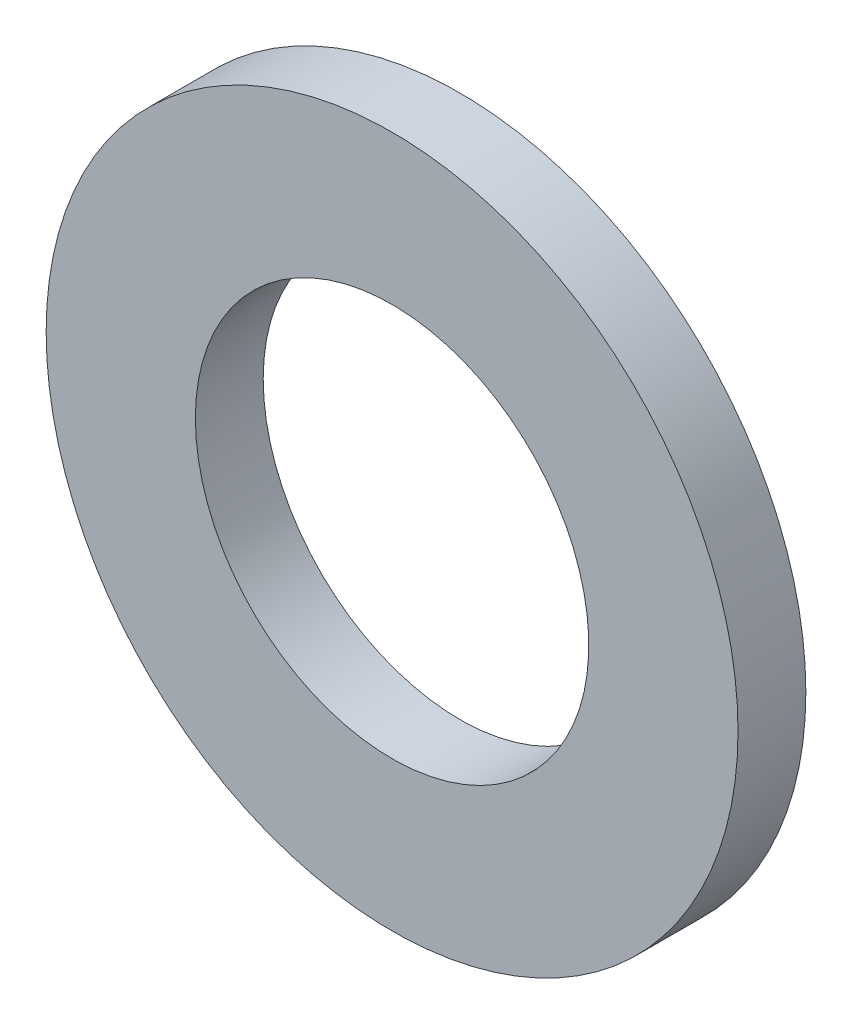
ISO-10303-21;
HEADER;
FILE_DESCRIPTION(('STEP AP214'),'2;1');
FILE_NAME('part.step','',(''),(''),'','','');
FILE_SCHEMA(('AUTOMOTIVE_DESIGN { 1 0 10303 214 1 1 1 1 }'));
ENDSEC;
DATA;
#1=APPLICATION_CONTEXT('core data for automotive mechanical design processes');
#2=APPLICATION_PROTOCOL_DEFINITION('international standard','automotive_design',2000,#1);
#3=PRODUCT_CONTEXT('',#1,'mechanical');
#4=PRODUCT('Part','Part','',(#3));
#5=PRODUCT_RELATED_PRODUCT_CATEGORY('part','',(#4));
#6=PRODUCT_DEFINITION_FORMATION('','',#4);
#7=PRODUCT_DEFINITION_CONTEXT('part definition',#1,'design');
#8=PRODUCT_DEFINITION('design','',#6,#7);
#9=PRODUCT_DEFINITION_SHAPE('','',#8);
#10=(LENGTH_UNIT() NAMED_UNIT(*) SI_UNIT(.MILLI.,.METRE.));
#11=(NAMED_UNIT(*) PLANE_ANGLE_UNIT() SI_UNIT($,.RADIAN.));
#12=(NAMED_UNIT(*) SI_UNIT($,.STERADIAN.) SOLID_ANGLE_UNIT());
#13=UNCERTAINTY_MEASURE_WITH_UNIT(LENGTH_MEASURE(1.E-05),#10,'distance_accuracy_value','');
#14=(GEOMETRIC_REPRESENTATION_CONTEXT(3) GLOBAL_UNCERTAINTY_ASSIGNED_CONTEXT((#13)) GLOBAL_UNIT_ASSIGNED_CONTEXT((#10,
#11,#12)) REPRESENTATION_CONTEXT('',''));
#15=CARTESIAN_POINT('',(0.,0.,0.));
#16=DIRECTION('',(0.,0.,1.));
#17=DIRECTION('',(1.,0.,0.));
#18=AXIS2_PLACEMENT_3D('',#15,#16,#17);
#19=CARTESIAN_POINT('',(2.55,0.,0.5));
#20=DIRECTION('',(0.,0.,1.));
#21=DIRECTION('',(1.,0.,0.));
#22=AXIS2_PLACEMENT_3D('',#19,#20,#21);
#23=PLANE('',#22);
#24=CARTESIAN_POINT('',(0.,0.,0.5));
#25=DIRECTION('',(0.,0.,-1.));
#26=DIRECTION('',(-1.,0.,0.));
#27=AXIS2_PLACEMENT_3D('',#24,#25,#26);
#28=CIRCLE('',#27,1.45);
#29=CARTESIAN_POINT('',(-1.45,0.,0.5));
#30=VERTEX_POINT('',#29);
#31=EDGE_CURVE('E10',#30,#30,#28,.T.);
#32=ORIENTED_EDGE('',*,*,#31,.T.);
#33=EDGE_LOOP('',(#32));
#34=FACE_BOUND('',#33,.T.);
#35=CARTESIAN_POINT('',(0.,0.,0.5));
#36=DIRECTION('',(0.,0.,-1.));
#37=DIRECTION('',(-1.,0.,0.));
#38=AXIS2_PLACEMENT_3D('',#35,#36,#37);
#39=CIRCLE('',#38,2.55);
#40=CARTESIAN_POINT('',(-2.55,0.,0.5));
#41=VERTEX_POINT('',#40);
#42=EDGE_CURVE('E49',#41,#41,#39,.T.);
#43=ORIENTED_EDGE('',*,*,#42,.F.);
#44=EDGE_LOOP('',(#43));
#45=FACE_BOUND('',#44,.T.);
#46=ADVANCED_FACE('F35',(#34,#45),#23,.T.);
#47=CARTESIAN_POINT('',(0.,0.,0.5));
#48=DIRECTION('',(0.,0.,-1.));
#49=DIRECTION('',(-1.,0.,0.));
#50=AXIS2_PLACEMENT_3D('',#47,#48,#49);
#51=CYLINDRICAL_SURFACE('',#50,1.45);
#52=CARTESIAN_POINT('',(0.,0.,0.));
#53=DIRECTION('',(0.,0.,-1.));
#54=DIRECTION('',(-1.,0.,0.));
#55=AXIS2_PLACEMENT_3D('',#52,#53,#54);
#56=CIRCLE('',#55,1.45);
#57=CARTESIAN_POINT('',(-1.45,0.,0.));
#58=VERTEX_POINT('',#57);
#59=EDGE_CURVE('E41',#58,#58,#56,.T.);
#60=ORIENTED_EDGE('',*,*,#59,.T.);
#61=EDGE_LOOP('',(#60));
#62=FACE_BOUND('',#61,.T.);
#63=ORIENTED_EDGE('',*,*,#31,.F.);
#64=EDGE_LOOP('',(#63));
#65=FACE_BOUND('',#64,.T.);
#66=ADVANCED_FACE('F59',(#62,#65),#51,.F.);
#67=CARTESIAN_POINT('',(1.45,0.,0.));
#68=DIRECTION('',(0.,0.,-1.));
#69=DIRECTION('',(-1.,0.,0.));
#70=AXIS2_PLACEMENT_3D('',#67,#68,#69);
#71=PLANE('',#70);
#72=CARTESIAN_POINT('',(0.,0.,0.));
#73=DIRECTION('',(0.,0.,-1.));
#74=DIRECTION('',(-1.,0.,0.));
#75=AXIS2_PLACEMENT_3D('',#72,#73,#74);
#76=CIRCLE('',#75,2.55);
#77=CARTESIAN_POINT('',(-2.55,0.,0.));
#78=VERTEX_POINT('',#77);
#79=EDGE_CURVE('E45',#78,#78,#76,.T.);
#80=ORIENTED_EDGE('',*,*,#79,.T.);
#81=EDGE_LOOP('',(#80));
#82=FACE_BOUND('',#81,.T.);
#83=ORIENTED_EDGE('',*,*,#59,.F.);
#84=EDGE_LOOP('',(#83));
#85=FACE_BOUND('',#84,.T.);
#86=ADVANCED_FACE('F63',(#82,#85),#71,.T.);
#87=CARTESIAN_POINT('',(0.,0.,0.5));
#88=DIRECTION('',(0.,0.,-1.));
#89=DIRECTION('',(-1.,0.,0.));
#90=AXIS2_PLACEMENT_3D('',#87,#88,#89);
#91=CYLINDRICAL_SURFACE('',#90,2.55);
#92=ORIENTED_EDGE('',*,*,#42,.T.);
#93=EDGE_LOOP('',(#92));
#94=FACE_BOUND('',#93,.T.);
#95=ORIENTED_EDGE('',*,*,#79,.F.);
#96=EDGE_LOOP('',(#95));
#97=FACE_BOUND('',#96,.T.);
#98=ADVANCED_FACE('F55',(#94,#97),#91,.T.);
#99=CLOSED_SHELL('',(#46,#66,#86,#98));
#100=MANIFOLD_SOLID_BREP('B2',#99);
#101=ADVANCED_BREP_SHAPE_REPRESENTATION('',(#18,#100),#14);
#102=SHAPE_DEFINITION_REPRESENTATION(#9,#101);
ENDSEC;
END-ISO-10303-21;
